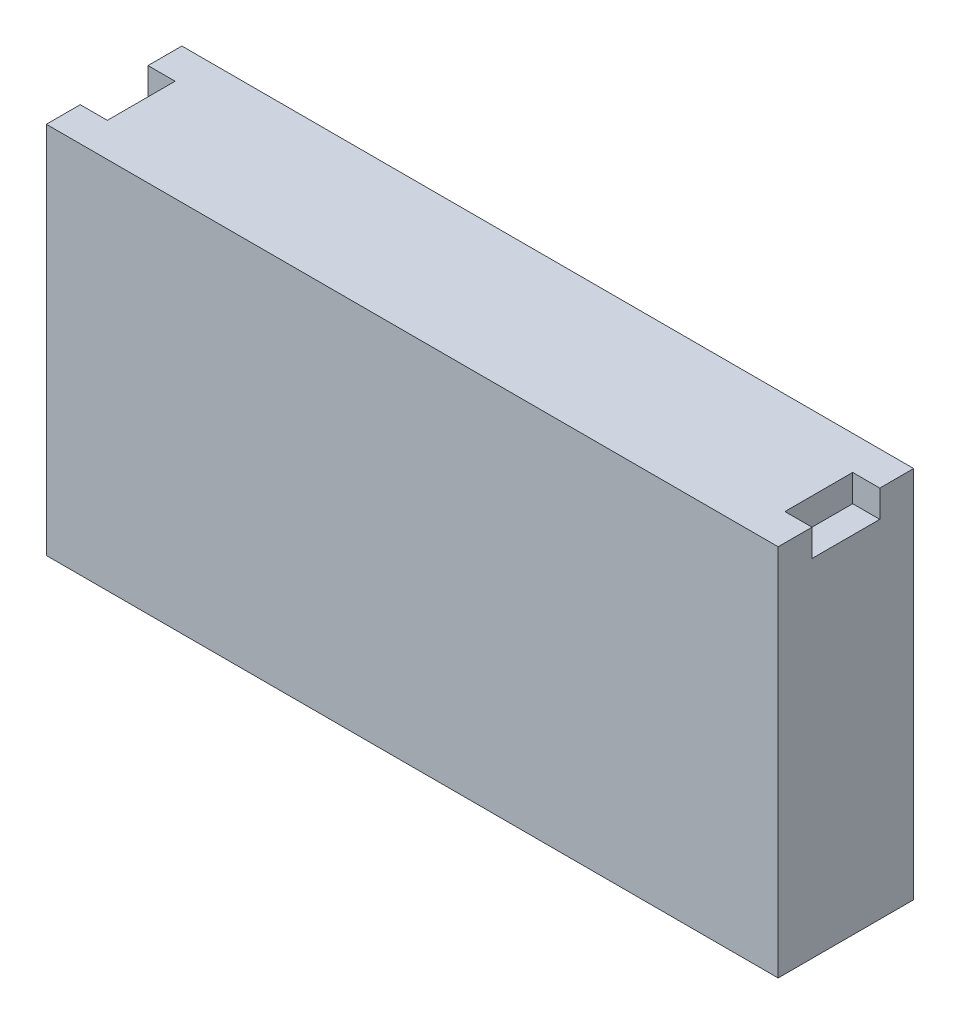
ISO-10303-21;
HEADER;
FILE_DESCRIPTION(('STEP AP214'),'2;1');
FILE_NAME('part.step','',(''),(''),'','','');
FILE_SCHEMA(('AUTOMOTIVE_DESIGN { 1 0 10303 214 1 1 1 1 }'));
ENDSEC;
DATA;
#1=APPLICATION_CONTEXT('core data for automotive mechanical design processes');
#2=APPLICATION_PROTOCOL_DEFINITION('international standard','automotive_design',2000,#1);
#3=PRODUCT_CONTEXT('',#1,'mechanical');
#4=PRODUCT('Part','Part','',(#3));
#5=PRODUCT_RELATED_PRODUCT_CATEGORY('part','',(#4));
#6=PRODUCT_DEFINITION_FORMATION('','',#4);
#7=PRODUCT_DEFINITION_CONTEXT('part definition',#1,'design');
#8=PRODUCT_DEFINITION('design','',#6,#7);
#9=PRODUCT_DEFINITION_SHAPE('','',#8);
#10=(LENGTH_UNIT() NAMED_UNIT(*) SI_UNIT(.MILLI.,.METRE.));
#11=(NAMED_UNIT(*) PLANE_ANGLE_UNIT() SI_UNIT($,.RADIAN.));
#12=(NAMED_UNIT(*) SI_UNIT($,.STERADIAN.) SOLID_ANGLE_UNIT());
#13=UNCERTAINTY_MEASURE_WITH_UNIT(LENGTH_MEASURE(1.E-05),#10,'distance_accuracy_value','');
#14=(GEOMETRIC_REPRESENTATION_CONTEXT(3) GLOBAL_UNCERTAINTY_ASSIGNED_CONTEXT((#13)) GLOBAL_UNIT_ASSIGNED_CONTEXT((#10,
#11,#12)) REPRESENTATION_CONTEXT('',''));
#15=CARTESIAN_POINT('',(0.,0.,0.));
#16=DIRECTION('',(0.,0.,1.));
#17=DIRECTION('',(1.,0.,0.));
#18=AXIS2_PLACEMENT_3D('',#15,#16,#17);
#19=CARTESIAN_POINT('',(342.9,350.,-63.5));
#20=DIRECTION('',(-1.,0.,0.));
#21=DIRECTION('',(0.,0.,1.));
#22=AXIS2_PLACEMENT_3D('',#19,#20,#21);
#23=PLANE('',#22);
#24=DIRECTION('',(0.,0.,-1.));
#25=VECTOR('',#24,1.);
#26=CARTESIAN_POINT('',(342.9,324.6,-31.75));
#27=LINE('',#26,#25);
#28=CARTESIAN_POINT('',(342.9,324.6,31.75));
#29=VERTEX_POINT('',#28);
#30=CARTESIAN_POINT('',(342.9,324.6,-31.75));
#31=VERTEX_POINT('',#30);
#32=EDGE_CURVE('E164',#29,#31,#27,.T.);
#33=ORIENTED_EDGE('',*,*,#32,.F.);
#34=DIRECTION('',(0.,1.,0.));
#35=VECTOR('',#34,1.);
#36=CARTESIAN_POINT('',(342.9,324.6,31.75));
#37=LINE('',#36,#35);
#38=CARTESIAN_POINT('',(342.9,350.,31.75));
#39=VERTEX_POINT('',#38);
#40=EDGE_CURVE('E190',#29,#39,#37,.T.);
#41=ORIENTED_EDGE('',*,*,#40,.T.);
#42=DIRECTION('',(0.,0.,-1.));
#43=VECTOR('',#42,1.);
#44=CARTESIAN_POINT('',(342.9,350.,-63.5));
#45=LINE('',#44,#43);
#46=CARTESIAN_POINT('',(342.9,350.,63.5));
#47=VERTEX_POINT('',#46);
#48=EDGE_CURVE('E203',#47,#39,#45,.T.);
#49=ORIENTED_EDGE('',*,*,#48,.F.);
#50=DIRECTION('',(0.,-1.,0.));
#51=VECTOR('',#50,1.);
#52=CARTESIAN_POINT('',(342.9,350.,63.5));
#53=LINE('',#52,#51);
#54=CARTESIAN_POINT('',(342.9,0.,63.5));
#55=VERTEX_POINT('',#54);
#56=EDGE_CURVE('E218',#47,#55,#53,.T.);
#57=ORIENTED_EDGE('',*,*,#56,.T.);
#58=DIRECTION('',(0.,0.,-1.));
#59=VECTOR('',#58,1.);
#60=CARTESIAN_POINT('',(342.9,0.,-63.5));
#61=LINE('',#60,#59);
#62=CARTESIAN_POINT('',(342.9,0.,-63.5));
#63=VERTEX_POINT('',#62);
#64=EDGE_CURVE('E219',#55,#63,#61,.T.);
#65=ORIENTED_EDGE('',*,*,#64,.T.);
#66=DIRECTION('',(0.,-1.,0.));
#67=VECTOR('',#66,1.);
#68=CARTESIAN_POINT('',(342.9,350.,-63.5));
#69=LINE('',#68,#67);
#70=CARTESIAN_POINT('',(342.9,350.,-63.5));
#71=VERTEX_POINT('',#70);
#72=EDGE_CURVE('E11',#71,#63,#69,.T.);
#73=ORIENTED_EDGE('',*,*,#72,.F.);
#74=CARTESIAN_POINT('',(342.9,350.,-31.75));
#75=VERTEX_POINT('',#74);
#76=EDGE_CURVE('E208',#75,#71,#45,.T.);
#77=ORIENTED_EDGE('',*,*,#76,.F.);
#78=DIRECTION('',(0.,1.,0.));
#79=VECTOR('',#78,1.);
#80=CARTESIAN_POINT('',(342.9,324.6,-31.75));
#81=LINE('',#80,#79);
#82=EDGE_CURVE('E64',#31,#75,#81,.T.);
#83=ORIENTED_EDGE('',*,*,#82,.F.);
#84=EDGE_LOOP('',(#33,#41,#49,#57,#65,#73,#77,#83));
#85=FACE_BOUND('',#84,.T.);
#86=ADVANCED_FACE('F41',(#85),#23,.F.);
#87=CARTESIAN_POINT('',(-342.9,350.,-63.5));
#88=DIRECTION('',(0.,0.,1.));
#89=DIRECTION('',(1.,0.,0.));
#90=AXIS2_PLACEMENT_3D('',#87,#88,#89);
#91=PLANE('',#90);
#92=DIRECTION('',(-1.,0.,0.));
#93=VECTOR('',#92,1.);
#94=CARTESIAN_POINT('',(-342.9,0.,-63.5));
#95=LINE('',#94,#93);
#96=CARTESIAN_POINT('',(-342.9,0.,-63.5));
#97=VERTEX_POINT('',#96);
#98=EDGE_CURVE('E223',#63,#97,#95,.T.);
#99=ORIENTED_EDGE('',*,*,#98,.T.);
#100=DIRECTION('',(0.,-1.,0.));
#101=VECTOR('',#100,1.);
#102=CARTESIAN_POINT('',(-342.9,350.,-63.5));
#103=LINE('',#102,#101);
#104=CARTESIAN_POINT('',(-342.9,350.,-63.5));
#105=VERTEX_POINT('',#104);
#106=EDGE_CURVE('E49',#105,#97,#103,.T.);
#107=ORIENTED_EDGE('',*,*,#106,.F.);
#108=DIRECTION('',(-1.,0.,0.));
#109=VECTOR('',#108,1.);
#110=CARTESIAN_POINT('',(-342.9,350.,-63.5));
#111=LINE('',#110,#109);
#112=EDGE_CURVE('E207',#71,#105,#111,.T.);
#113=ORIENTED_EDGE('',*,*,#112,.F.);
#114=ORIENTED_EDGE('',*,*,#72,.T.);
#115=EDGE_LOOP('',(#99,#107,#113,#114));
#116=FACE_BOUND('',#115,.T.);
#117=ADVANCED_FACE('F283',(#116),#91,.F.);
#118=CARTESIAN_POINT('',(-342.9,350.,-63.5));
#119=DIRECTION('',(1.,0.,0.));
#120=DIRECTION('',(0.,0.,-1.));
#121=AXIS2_PLACEMENT_3D('',#118,#119,#120);
#122=PLANE('',#121);
#123=DIRECTION('',(0.,0.,1.));
#124=VECTOR('',#123,1.);
#125=CARTESIAN_POINT('',(-342.9,324.6,-31.75));
#126=LINE('',#125,#124);
#127=CARTESIAN_POINT('',(-342.9,324.6,-31.75));
#128=VERTEX_POINT('',#127);
#129=CARTESIAN_POINT('',(-342.9,324.6,31.75));
#130=VERTEX_POINT('',#129);
#131=EDGE_CURVE('E139',#128,#130,#126,.T.);
#132=ORIENTED_EDGE('',*,*,#131,.F.);
#133=DIRECTION('',(0.,1.,0.));
#134=VECTOR('',#133,1.);
#135=CARTESIAN_POINT('',(-342.9,324.6,-31.75));
#136=LINE('',#135,#134);
#137=CARTESIAN_POINT('',(-342.9,350.,-31.75));
#138=VERTEX_POINT('',#137);
#139=EDGE_CURVE('E224',#128,#138,#136,.T.);
#140=ORIENTED_EDGE('',*,*,#139,.T.);
#141=DIRECTION('',(0.,0.,1.));
#142=VECTOR('',#141,1.);
#143=CARTESIAN_POINT('',(-342.9,350.,-63.5));
#144=LINE('',#143,#142);
#145=EDGE_CURVE('E211',#105,#138,#144,.T.);
#146=ORIENTED_EDGE('',*,*,#145,.F.);
#147=ORIENTED_EDGE('',*,*,#106,.T.);
#148=DIRECTION('',(0.,0.,1.));
#149=VECTOR('',#148,1.);
#150=CARTESIAN_POINT('',(-342.9,0.,-63.5));
#151=LINE('',#150,#149);
#152=CARTESIAN_POINT('',(-342.9,0.,63.5));
#153=VERTEX_POINT('',#152);
#154=EDGE_CURVE('E227',#97,#153,#151,.T.);
#155=ORIENTED_EDGE('',*,*,#154,.T.);
#156=DIRECTION('',(0.,-1.,0.));
#157=VECTOR('',#156,1.);
#158=CARTESIAN_POINT('',(-342.9,350.,63.5));
#159=LINE('',#158,#157);
#160=CARTESIAN_POINT('',(-342.9,350.,63.5));
#161=VERTEX_POINT('',#160);
#162=EDGE_CURVE('E236',#161,#153,#159,.T.);
#163=ORIENTED_EDGE('',*,*,#162,.F.);
#164=CARTESIAN_POINT('',(-342.9,350.,31.75));
#165=VERTEX_POINT('',#164);
#166=EDGE_CURVE('E154',#165,#161,#144,.T.);
#167=ORIENTED_EDGE('',*,*,#166,.F.);
#168=DIRECTION('',(0.,1.,0.));
#169=VECTOR('',#168,1.);
#170=CARTESIAN_POINT('',(-342.9,324.6,31.75));
#171=LINE('',#170,#169);
#172=EDGE_CURVE('E56',#130,#165,#171,.T.);
#173=ORIENTED_EDGE('',*,*,#172,.F.);
#174=EDGE_LOOP('',(#132,#140,#146,#147,#155,#163,#167,#173));
#175=FACE_BOUND('',#174,.T.);
#176=ADVANCED_FACE('F152',(#175),#122,.F.);
#177=CARTESIAN_POINT('',(-342.9,350.,63.5));
#178=DIRECTION('',(0.,0.,-1.));
#179=DIRECTION('',(-1.,0.,0.));
#180=AXIS2_PLACEMENT_3D('',#177,#178,#179);
#181=PLANE('',#180);
#182=DIRECTION('',(1.,0.,0.));
#183=VECTOR('',#182,1.);
#184=CARTESIAN_POINT('',(-342.9,0.,63.5));
#185=LINE('',#184,#183);
#186=EDGE_CURVE('E230',#153,#55,#185,.T.);
#187=ORIENTED_EDGE('',*,*,#186,.T.);
#188=ORIENTED_EDGE('',*,*,#56,.F.);
#189=DIRECTION('',(1.,0.,0.));
#190=VECTOR('',#189,1.);
#191=CARTESIAN_POINT('',(-342.9,350.,63.5));
#192=LINE('',#191,#190);
#193=EDGE_CURVE('E215',#161,#47,#192,.T.);
#194=ORIENTED_EDGE('',*,*,#193,.F.);
#195=ORIENTED_EDGE('',*,*,#162,.T.);
#196=EDGE_LOOP('',(#187,#188,#194,#195));
#197=FACE_BOUND('',#196,.T.);
#198=ADVANCED_FACE('F252',(#197),#181,.F.);
#199=CARTESIAN_POINT('',(0.,350.,0.));
#200=DIRECTION('',(0.,1.,0.));
#201=DIRECTION('',(0.,0.,1.));
#202=AXIS2_PLACEMENT_3D('',#199,#200,#201);
#203=PLANE('',#202);
#204=DIRECTION('',(-1.,0.,0.));
#205=VECTOR('',#204,1.);
#206=CARTESIAN_POINT('',(-342.9,350.,-31.75));
#207=LINE('',#206,#205);
#208=CARTESIAN_POINT('',(-317.5,350.,-31.75));
#209=VERTEX_POINT('',#208);
#210=EDGE_CURVE('E149',#209,#138,#207,.T.);
#211=ORIENTED_EDGE('',*,*,#210,.F.);
#212=DIRECTION('',(0.,0.,-1.));
#213=VECTOR('',#212,1.);
#214=CARTESIAN_POINT('',(-317.5,350.,-31.75));
#215=LINE('',#214,#213);
#216=CARTESIAN_POINT('',(-317.5,350.,31.75));
#217=VERTEX_POINT('',#216);
#218=EDGE_CURVE('E274',#217,#209,#215,.T.);
#219=ORIENTED_EDGE('',*,*,#218,.F.);
#220=DIRECTION('',(1.,0.,0.));
#221=VECTOR('',#220,1.);
#222=CARTESIAN_POINT('',(-342.9,350.,31.75));
#223=LINE('',#222,#221);
#224=EDGE_CURVE('E194',#165,#217,#223,.T.);
#225=ORIENTED_EDGE('',*,*,#224,.F.);
#226=ORIENTED_EDGE('',*,*,#166,.T.);
#227=ORIENTED_EDGE('',*,*,#193,.T.);
#228=ORIENTED_EDGE('',*,*,#48,.T.);
#229=DIRECTION('',(1.,0.,0.));
#230=VECTOR('',#229,1.);
#231=CARTESIAN_POINT('',(342.9,350.,31.75));
#232=LINE('',#231,#230);
#233=CARTESIAN_POINT('',(317.5,350.,31.75));
#234=VERTEX_POINT('',#233);
#235=EDGE_CURVE('E169',#234,#39,#232,.T.);
#236=ORIENTED_EDGE('',*,*,#235,.F.);
#237=DIRECTION('',(0.,0.,1.));
#238=VECTOR('',#237,1.);
#239=CARTESIAN_POINT('',(317.5,350.,-31.75));
#240=LINE('',#239,#238);
#241=CARTESIAN_POINT('',(317.5,350.,-31.75));
#242=VERTEX_POINT('',#241);
#243=EDGE_CURVE('E184',#242,#234,#240,.T.);
#244=ORIENTED_EDGE('',*,*,#243,.F.);
#245=DIRECTION('',(-1.,0.,0.));
#246=VECTOR('',#245,1.);
#247=CARTESIAN_POINT('',(342.9,350.,-31.75));
#248=LINE('',#247,#246);
#249=EDGE_CURVE('E181',#75,#242,#248,.T.);
#250=ORIENTED_EDGE('',*,*,#249,.F.);
#251=ORIENTED_EDGE('',*,*,#76,.T.);
#252=ORIENTED_EDGE('',*,*,#112,.T.);
#253=ORIENTED_EDGE('',*,*,#145,.T.);
#254=EDGE_LOOP('',(#211,#219,#225,#226,#227,#228,#236,#244,#250,#251,#252,#253));
#255=FACE_BOUND('',#254,.T.);
#256=ADVANCED_FACE('F261',(#255),#203,.T.);
#257=CARTESIAN_POINT('',(0.,0.,0.));
#258=DIRECTION('',(0.,1.,0.));
#259=DIRECTION('',(0.,0.,1.));
#260=AXIS2_PLACEMENT_3D('',#257,#258,#259);
#261=PLANE('',#260);
#262=ORIENTED_EDGE('',*,*,#64,.F.);
#263=ORIENTED_EDGE('',*,*,#186,.F.);
#264=ORIENTED_EDGE('',*,*,#154,.F.);
#265=ORIENTED_EDGE('',*,*,#98,.F.);
#266=EDGE_LOOP('',(#262,#263,#264,#265));
#267=FACE_BOUND('',#266,.T.);
#268=ADVANCED_FACE('F249',(#267),#261,.F.);
#269=CARTESIAN_POINT('',(342.9,324.6,31.75));
#270=DIRECTION('',(0.,0.,1.));
#271=DIRECTION('',(1.,0.,0.));
#272=AXIS2_PLACEMENT_3D('',#269,#270,#271);
#273=PLANE('',#272);
#274=ORIENTED_EDGE('',*,*,#235,.T.);
#275=ORIENTED_EDGE('',*,*,#40,.F.);
#276=DIRECTION('',(1.,0.,0.));
#277=VECTOR('',#276,1.);
#278=CARTESIAN_POINT('',(342.9,324.6,31.75));
#279=LINE('',#278,#277);
#280=CARTESIAN_POINT('',(317.5,324.6,31.75));
#281=VERTEX_POINT('',#280);
#282=EDGE_CURVE('E177',#281,#29,#279,.T.);
#283=ORIENTED_EDGE('',*,*,#282,.F.);
#284=DIRECTION('',(0.,1.,0.));
#285=VECTOR('',#284,1.);
#286=CARTESIAN_POINT('',(317.5,324.6,31.75));
#287=LINE('',#286,#285);
#288=EDGE_CURVE('E195',#281,#234,#287,.T.);
#289=ORIENTED_EDGE('',*,*,#288,.T.);
#290=EDGE_LOOP('',(#274,#275,#283,#289));
#291=FACE_BOUND('',#290,.T.);
#292=ADVANCED_FACE('F289',(#291),#273,.F.);
#293=CARTESIAN_POINT('',(317.5,324.6,-31.75));
#294=DIRECTION('',(-1.,0.,0.));
#295=DIRECTION('',(0.,0.,1.));
#296=AXIS2_PLACEMENT_3D('',#293,#294,#295);
#297=PLANE('',#296);
#298=ORIENTED_EDGE('',*,*,#243,.T.);
#299=ORIENTED_EDGE('',*,*,#288,.F.);
#300=DIRECTION('',(0.,0.,1.));
#301=VECTOR('',#300,1.);
#302=CARTESIAN_POINT('',(317.5,324.6,-31.75));
#303=LINE('',#302,#301);
#304=CARTESIAN_POINT('',(317.5,324.6,-31.75));
#305=VERTEX_POINT('',#304);
#306=EDGE_CURVE('E173',#305,#281,#303,.T.);
#307=ORIENTED_EDGE('',*,*,#306,.F.);
#308=DIRECTION('',(0.,1.,0.));
#309=VECTOR('',#308,1.);
#310=CARTESIAN_POINT('',(317.5,324.6,-31.75));
#311=LINE('',#310,#309);
#312=EDGE_CURVE('E198',#305,#242,#311,.T.);
#313=ORIENTED_EDGE('',*,*,#312,.T.);
#314=EDGE_LOOP('',(#298,#299,#307,#313));
#315=FACE_BOUND('',#314,.T.);
#316=ADVANCED_FACE('F291',(#315),#297,.F.);
#317=CARTESIAN_POINT('',(342.9,324.6,-31.75));
#318=DIRECTION('',(0.,0.,-1.));
#319=DIRECTION('',(-1.,0.,0.));
#320=AXIS2_PLACEMENT_3D('',#317,#318,#319);
#321=PLANE('',#320);
#322=ORIENTED_EDGE('',*,*,#249,.T.);
#323=ORIENTED_EDGE('',*,*,#312,.F.);
#324=DIRECTION('',(-1.,0.,0.));
#325=VECTOR('',#324,1.);
#326=CARTESIAN_POINT('',(342.9,324.6,-31.75));
#327=LINE('',#326,#325);
#328=EDGE_CURVE('E168',#31,#305,#327,.T.);
#329=ORIENTED_EDGE('',*,*,#328,.F.);
#330=ORIENTED_EDGE('',*,*,#82,.T.);
#331=EDGE_LOOP('',(#322,#323,#329,#330));
#332=FACE_BOUND('',#331,.T.);
#333=ADVANCED_FACE('F292',(#332),#321,.F.);
#334=CARTESIAN_POINT('',(0.,324.6,0.));
#335=DIRECTION('',(0.,-1.,0.));
#336=DIRECTION('',(0.,0.,-1.));
#337=AXIS2_PLACEMENT_3D('',#334,#335,#336);
#338=PLANE('',#337);
#339=ORIENTED_EDGE('',*,*,#32,.T.);
#340=ORIENTED_EDGE('',*,*,#328,.T.);
#341=ORIENTED_EDGE('',*,*,#306,.T.);
#342=ORIENTED_EDGE('',*,*,#282,.T.);
#343=EDGE_LOOP('',(#339,#340,#341,#342));
#344=FACE_BOUND('',#343,.T.);
#345=ADVANCED_FACE('F285',(#344),#338,.F.);
#346=CARTESIAN_POINT('',(-342.9,324.6,-31.75));
#347=DIRECTION('',(0.,0.,-1.));
#348=DIRECTION('',(-1.,0.,0.));
#349=AXIS2_PLACEMENT_3D('',#346,#347,#348);
#350=PLANE('',#349);
#351=ORIENTED_EDGE('',*,*,#210,.T.);
#352=ORIENTED_EDGE('',*,*,#139,.F.);
#353=DIRECTION('',(-1.,0.,0.));
#354=VECTOR('',#353,1.);
#355=CARTESIAN_POINT('',(-342.9,324.6,-31.75));
#356=LINE('',#355,#354);
#357=CARTESIAN_POINT('',(-317.5,324.6,-31.75));
#358=VERTEX_POINT('',#357);
#359=EDGE_CURVE('E145',#358,#128,#356,.T.);
#360=ORIENTED_EDGE('',*,*,#359,.F.);
#361=DIRECTION('',(0.,1.,0.));
#362=VECTOR('',#361,1.);
#363=CARTESIAN_POINT('',(-317.5,324.6,-31.75));
#364=LINE('',#363,#362);
#365=EDGE_CURVE('E159',#358,#209,#364,.T.);
#366=ORIENTED_EDGE('',*,*,#365,.T.);
#367=EDGE_LOOP('',(#351,#352,#360,#366));
#368=FACE_BOUND('',#367,.T.);
#369=ADVANCED_FACE('F281',(#368),#350,.F.);
#370=CARTESIAN_POINT('',(-317.5,324.6,-31.75));
#371=DIRECTION('',(1.,0.,0.));
#372=DIRECTION('',(0.,0.,-1.));
#373=AXIS2_PLACEMENT_3D('',#370,#371,#372);
#374=PLANE('',#373);
#375=ORIENTED_EDGE('',*,*,#218,.T.);
#376=ORIENTED_EDGE('',*,*,#365,.F.);
#377=DIRECTION('',(0.,0.,-1.));
#378=VECTOR('',#377,1.);
#379=CARTESIAN_POINT('',(-317.5,324.6,-31.75));
#380=LINE('',#379,#378);
#381=CARTESIAN_POINT('',(-317.5,324.6,31.75));
#382=VERTEX_POINT('',#381);
#383=EDGE_CURVE('E138',#382,#358,#380,.T.);
#384=ORIENTED_EDGE('',*,*,#383,.F.);
#385=DIRECTION('',(0.,1.,0.));
#386=VECTOR('',#385,1.);
#387=CARTESIAN_POINT('',(-317.5,324.6,31.75));
#388=LINE('',#387,#386);
#389=EDGE_CURVE('E133',#382,#217,#388,.T.);
#390=ORIENTED_EDGE('',*,*,#389,.T.);
#391=EDGE_LOOP('',(#375,#376,#384,#390));
#392=FACE_BOUND('',#391,.T.);
#393=ADVANCED_FACE('F353',(#392),#374,.F.);
#394=CARTESIAN_POINT('',(-342.9,324.6,31.75));
#395=DIRECTION('',(0.,0.,1.));
#396=DIRECTION('',(1.,0.,0.));
#397=AXIS2_PLACEMENT_3D('',#394,#395,#396);
#398=PLANE('',#397);
#399=ORIENTED_EDGE('',*,*,#224,.T.);
#400=ORIENTED_EDGE('',*,*,#389,.F.);
#401=DIRECTION('',(1.,0.,0.));
#402=VECTOR('',#401,1.);
#403=CARTESIAN_POINT('',(-342.9,324.6,31.75));
#404=LINE('',#403,#402);
#405=EDGE_CURVE('E130',#130,#382,#404,.T.);
#406=ORIENTED_EDGE('',*,*,#405,.F.);
#407=ORIENTED_EDGE('',*,*,#172,.T.);
#408=EDGE_LOOP('',(#399,#400,#406,#407));
#409=FACE_BOUND('',#408,.T.);
#410=ADVANCED_FACE('F132',(#409),#398,.F.);
#411=CARTESIAN_POINT('',(0.,324.6,0.));
#412=DIRECTION('',(0.,1.,0.));
#413=DIRECTION('',(0.,0.,1.));
#414=AXIS2_PLACEMENT_3D('',#411,#412,#413);
#415=PLANE('',#414);
#416=ORIENTED_EDGE('',*,*,#131,.T.);
#417=ORIENTED_EDGE('',*,*,#405,.T.);
#418=ORIENTED_EDGE('',*,*,#383,.T.);
#419=ORIENTED_EDGE('',*,*,#359,.T.);
#420=EDGE_LOOP('',(#416,#417,#418,#419));
#421=FACE_BOUND('',#420,.T.);
#422=ADVANCED_FACE('F143',(#421),#415,.T.);
#423=CLOSED_SHELL('',(#86,#117,#176,#198,#256,#268,#292,#316,#333,#345,#369,#393,#410,#422));
#424=MANIFOLD_SOLID_BREP('B2',#423);
#425=ADVANCED_BREP_SHAPE_REPRESENTATION('',(#18,#424),#14);
#426=SHAPE_DEFINITION_REPRESENTATION(#9,#425);
ENDSEC;
END-ISO-10303-21;
